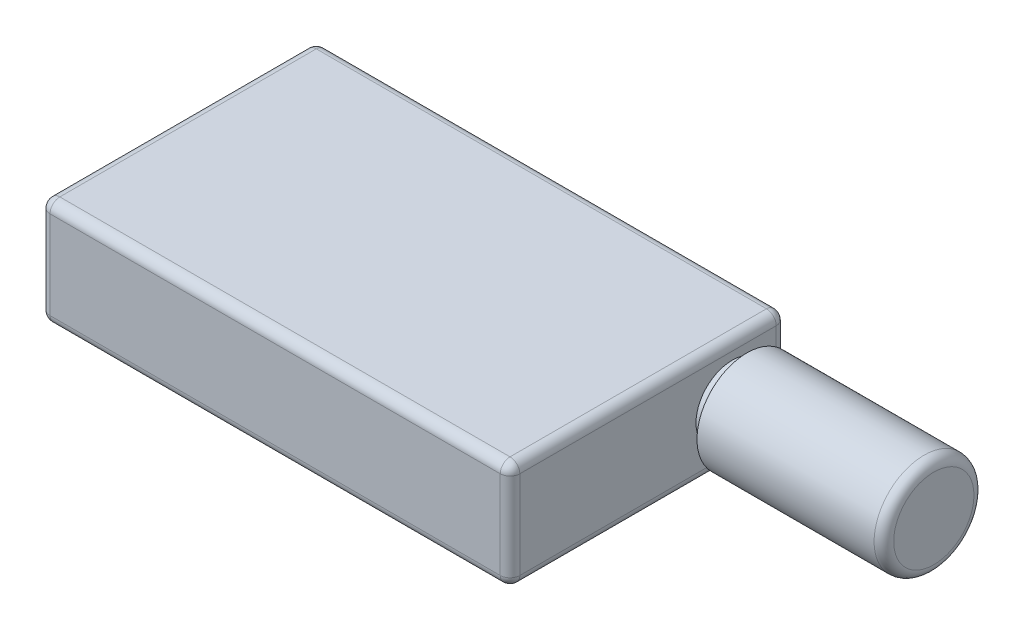
ISO-10303-21;
HEADER;
FILE_DESCRIPTION(('STEP AP214'),'2;1');
FILE_NAME('part.step','',(''),(''),'','','');
FILE_SCHEMA(('AUTOMOTIVE_DESIGN { 1 0 10303 214 1 1 1 1 }'));
ENDSEC;
DATA;
#1=APPLICATION_CONTEXT('core data for automotive mechanical design processes');
#2=APPLICATION_PROTOCOL_DEFINITION('international standard','automotive_design',2000,#1);
#3=PRODUCT_CONTEXT('',#1,'mechanical');
#4=PRODUCT('Part','Part','',(#3));
#5=PRODUCT_RELATED_PRODUCT_CATEGORY('part','',(#4));
#6=PRODUCT_DEFINITION_FORMATION('','',#4);
#7=PRODUCT_DEFINITION_CONTEXT('part definition',#1,'design');
#8=PRODUCT_DEFINITION('design','',#6,#7);
#9=PRODUCT_DEFINITION_SHAPE('','',#8);
#10=(LENGTH_UNIT() NAMED_UNIT(*) SI_UNIT(.MILLI.,.METRE.));
#11=(NAMED_UNIT(*) PLANE_ANGLE_UNIT() SI_UNIT($,.RADIAN.));
#12=(NAMED_UNIT(*) SI_UNIT($,.STERADIAN.) SOLID_ANGLE_UNIT());
#13=UNCERTAINTY_MEASURE_WITH_UNIT(LENGTH_MEASURE(1.E-05),#10,'distance_accuracy_value','');
#14=(GEOMETRIC_REPRESENTATION_CONTEXT(3) GLOBAL_UNCERTAINTY_ASSIGNED_CONTEXT((#13)) GLOBAL_UNIT_ASSIGNED_CONTEXT((#10,
#11,#12)) REPRESENTATION_CONTEXT('',''));
#15=CARTESIAN_POINT('',(0.,0.,0.));
#16=DIRECTION('',(0.,0.,1.));
#17=DIRECTION('',(1.,0.,0.));
#18=AXIS2_PLACEMENT_3D('',#15,#16,#17);
#19=CARTESIAN_POINT('',(0.,11.,0.));
#20=DIRECTION('',(1.,0.,0.));
#21=DIRECTION('',(0.,0.,-1.));
#22=AXIS2_PLACEMENT_3D('',#19,#20,#21);
#23=PLANE('',#22);
#24=DIRECTION('',(0.,0.,1.));
#25=VECTOR('',#24,1.);
#26=CARTESIAN_POINT('',(0.,10.,0.));
#27=LINE('',#26,#25);
#28=CARTESIAN_POINT('',(0.,10.,-1.));
#29=VERTEX_POINT('',#28);
#30=CARTESIAN_POINT('',(0.,10.,-27.2));
#31=VERTEX_POINT('',#30);
#32=EDGE_CURVE('E331',#29,#31,#27,.F.);
#33=ORIENTED_EDGE('',*,*,#32,.T.);
#34=DIRECTION('',(0.,-1.,0.));
#35=VECTOR('',#34,1.);
#36=CARTESIAN_POINT('',(0.,11.,-27.2));
#37=LINE('',#36,#35);
#38=CARTESIAN_POINT('',(0.,1.,-27.2));
#39=VERTEX_POINT('',#38);
#40=EDGE_CURVE('E389',#31,#39,#37,.T.);
#41=ORIENTED_EDGE('',*,*,#40,.T.);
#42=DIRECTION('',(0.,0.,1.));
#43=VECTOR('',#42,1.);
#44=CARTESIAN_POINT('',(0.,1.,0.));
#45=LINE('',#44,#43);
#46=CARTESIAN_POINT('',(0.,1.,-1.));
#47=VERTEX_POINT('',#46);
#48=EDGE_CURVE('E387',#39,#47,#45,.T.);
#49=ORIENTED_EDGE('',*,*,#48,.T.);
#50=DIRECTION('',(0.,-1.,0.));
#51=VECTOR('',#50,1.);
#52=CARTESIAN_POINT('',(0.,11.,-1.));
#53=LINE('',#52,#51);
#54=EDGE_CURVE('E385',#47,#29,#53,.F.);
#55=ORIENTED_EDGE('',*,*,#54,.T.);
#56=EDGE_LOOP('',(#33,#41,#49,#55));
#57=FACE_BOUND('',#56,.T.);
#58=ADVANCED_FACE('F45',(#57),#23,.F.);
#59=CARTESIAN_POINT('',(0.,11.,0.));
#60=DIRECTION('',(0.,0.,-1.));
#61=DIRECTION('',(-1.,0.,0.));
#62=AXIS2_PLACEMENT_3D('',#59,#60,#61);
#63=PLANE('',#62);
#64=DIRECTION('',(0.,-1.,0.));
#65=VECTOR('',#64,1.);
#66=CARTESIAN_POINT('',(1.,11.,0.));
#67=LINE('',#66,#65);
#68=CARTESIAN_POINT('',(1.,10.,0.));
#69=VERTEX_POINT('',#68);
#70=CARTESIAN_POINT('',(1.,1.,0.));
#71=VERTEX_POINT('',#70);
#72=EDGE_CURVE('E396',#69,#71,#67,.T.);
#73=ORIENTED_EDGE('',*,*,#72,.T.);
#74=DIRECTION('',(1.,0.,0.));
#75=VECTOR('',#74,1.);
#76=CARTESIAN_POINT('',(48.,1.,0.));
#77=LINE('',#76,#75);
#78=CARTESIAN_POINT('',(47.,1.,0.));
#79=VERTEX_POINT('',#78);
#80=EDGE_CURVE('E338',#71,#79,#77,.T.);
#81=ORIENTED_EDGE('',*,*,#80,.T.);
#82=DIRECTION('',(0.,-1.,0.));
#83=VECTOR('',#82,1.);
#84=CARTESIAN_POINT('',(47.,11.,0.));
#85=LINE('',#84,#83);
#86=CARTESIAN_POINT('',(47.,10.,0.));
#87=VERTEX_POINT('',#86);
#88=EDGE_CURVE('E394',#79,#87,#85,.F.);
#89=ORIENTED_EDGE('',*,*,#88,.T.);
#90=DIRECTION('',(1.,0.,0.));
#91=VECTOR('',#90,1.);
#92=CARTESIAN_POINT('',(0.,10.,0.));
#93=LINE('',#92,#91);
#94=EDGE_CURVE('E392',#87,#69,#93,.F.);
#95=ORIENTED_EDGE('',*,*,#94,.T.);
#96=EDGE_LOOP('',(#73,#81,#89,#95));
#97=FACE_BOUND('',#96,.T.);
#98=ADVANCED_FACE('F238',(#97),#63,.F.);
#99=CARTESIAN_POINT('',(48.,11.,0.));
#100=DIRECTION('',(-1.,0.,0.));
#101=DIRECTION('',(0.,0.,1.));
#102=AXIS2_PLACEMENT_3D('',#99,#100,#101);
#103=PLANE('',#102);
#104=DIRECTION('',(0.,-1.,0.));
#105=VECTOR('',#104,1.);
#106=CARTESIAN_POINT('',(48.,11.,-1.));
#107=LINE('',#106,#105);
#108=CARTESIAN_POINT('',(48.,10.,-1.));
#109=VERTEX_POINT('',#108);
#110=CARTESIAN_POINT('',(48.,1.,-1.));
#111=VERTEX_POINT('',#110);
#112=EDGE_CURVE('E144',#109,#111,#107,.T.);
#113=ORIENTED_EDGE('',*,*,#112,.T.);
#114=DIRECTION('',(0.,0.,-1.));
#115=VECTOR('',#114,1.);
#116=CARTESIAN_POINT('',(48.,1.,-28.2));
#117=LINE('',#116,#115);
#118=CARTESIAN_POINT('',(48.,1.,-27.2));
#119=VERTEX_POINT('',#118);
#120=EDGE_CURVE('E140',#111,#119,#117,.T.);
#121=ORIENTED_EDGE('',*,*,#120,.T.);
#122=DIRECTION('',(0.,-1.,0.));
#123=VECTOR('',#122,1.);
#124=CARTESIAN_POINT('',(48.,11.,-27.2));
#125=LINE('',#124,#123);
#126=CARTESIAN_POINT('',(48.,10.,-27.2));
#127=VERTEX_POINT('',#126);
#128=EDGE_CURVE('E133',#119,#127,#125,.F.);
#129=ORIENTED_EDGE('',*,*,#128,.T.);
#130=DIRECTION('',(0.,0.,-1.));
#131=VECTOR('',#130,1.);
#132=CARTESIAN_POINT('',(48.,10.,0.));
#133=LINE('',#132,#131);
#134=EDGE_CURVE('E137',#127,#109,#133,.F.);
#135=ORIENTED_EDGE('',*,*,#134,.T.);
#136=EDGE_LOOP('',(#113,#121,#129,#135));
#137=FACE_BOUND('',#136,.T.);
#138=CARTESIAN_POINT('',(48.,5.5,-22.7));
#139=DIRECTION('',(-1.,0.,0.));
#140=DIRECTION('',(0.,0.,1.));
#141=AXIS2_PLACEMENT_3D('',#138,#139,#140);
#142=CIRCLE('',#141,3.7);
#143=CARTESIAN_POINT('',(48.,5.5,-19.));
#144=VERTEX_POINT('',#143);
#145=EDGE_CURVE('E155',#144,#144,#142,.F.);
#146=ORIENTED_EDGE('',*,*,#145,.F.);
#147=EDGE_LOOP('',(#146));
#148=FACE_BOUND('',#147,.T.);
#149=ADVANCED_FACE('F135',(#137,#148),#103,.F.);
#150=CARTESIAN_POINT('',(0.,11.,-28.2));
#151=DIRECTION('',(0.,0.,1.));
#152=DIRECTION('',(1.,0.,0.));
#153=AXIS2_PLACEMENT_3D('',#150,#151,#152);
#154=PLANE('',#153);
#155=DIRECTION('',(-1.,0.,0.));
#156=VECTOR('',#155,1.);
#157=CARTESIAN_POINT('',(0.,10.,-28.2));
#158=LINE('',#157,#156);
#159=CARTESIAN_POINT('',(1.,10.,-28.2));
#160=VERTEX_POINT('',#159);
#161=CARTESIAN_POINT('',(47.,10.,-28.2));
#162=VERTEX_POINT('',#161);
#163=EDGE_CURVE('E373',#160,#162,#158,.F.);
#164=ORIENTED_EDGE('',*,*,#163,.T.);
#165=DIRECTION('',(0.,-1.,0.));
#166=VECTOR('',#165,1.);
#167=CARTESIAN_POINT('',(47.,11.,-28.2));
#168=LINE('',#167,#166);
#169=CARTESIAN_POINT('',(47.,1.,-28.2));
#170=VERTEX_POINT('',#169);
#171=EDGE_CURVE('E167',#162,#170,#168,.T.);
#172=ORIENTED_EDGE('',*,*,#171,.T.);
#173=DIRECTION('',(-1.,0.,0.));
#174=VECTOR('',#173,1.);
#175=CARTESIAN_POINT('',(0.,1.,-28.2));
#176=LINE('',#175,#174);
#177=CARTESIAN_POINT('',(1.,1.,-28.2));
#178=VERTEX_POINT('',#177);
#179=EDGE_CURVE('E381',#170,#178,#176,.T.);
#180=ORIENTED_EDGE('',*,*,#179,.T.);
#181=DIRECTION('',(0.,-1.,0.));
#182=VECTOR('',#181,1.);
#183=CARTESIAN_POINT('',(1.,11.,-28.2));
#184=LINE('',#183,#182);
#185=EDGE_CURVE('E375',#178,#160,#184,.F.);
#186=ORIENTED_EDGE('',*,*,#185,.T.);
#187=EDGE_LOOP('',(#164,#172,#180,#186));
#188=FACE_BOUND('',#187,.T.);
#189=ADVANCED_FACE('F411',(#188),#154,.F.);
#190=CARTESIAN_POINT('',(0.,11.,0.));
#191=DIRECTION('',(0.,-1.,0.));
#192=DIRECTION('',(0.,0.,-1.));
#193=AXIS2_PLACEMENT_3D('',#190,#191,#192);
#194=PLANE('',#193);
#195=DIRECTION('',(0.,0.,-1.));
#196=VECTOR('',#195,1.);
#197=CARTESIAN_POINT('',(47.,11.,0.));
#198=LINE('',#197,#196);
#199=CARTESIAN_POINT('',(47.,11.,-1.));
#200=VERTEX_POINT('',#199);
#201=CARTESIAN_POINT('',(47.,11.,-27.2));
#202=VERTEX_POINT('',#201);
#203=EDGE_CURVE('E60',#200,#202,#198,.T.);
#204=ORIENTED_EDGE('',*,*,#203,.T.);
#205=DIRECTION('',(-1.,0.,0.));
#206=VECTOR('',#205,1.);
#207=CARTESIAN_POINT('',(0.,11.,-27.2));
#208=LINE('',#207,#206);
#209=CARTESIAN_POINT('',(1.,11.,-27.2));
#210=VERTEX_POINT('',#209);
#211=EDGE_CURVE('E219',#202,#210,#208,.T.);
#212=ORIENTED_EDGE('',*,*,#211,.T.);
#213=DIRECTION('',(0.,0.,1.));
#214=VECTOR('',#213,1.);
#215=CARTESIAN_POINT('',(1.,11.,0.));
#216=LINE('',#215,#214);
#217=CARTESIAN_POINT('',(1.,11.,-1.));
#218=VERTEX_POINT('',#217);
#219=EDGE_CURVE('E330',#210,#218,#216,.T.);
#220=ORIENTED_EDGE('',*,*,#219,.T.);
#221=DIRECTION('',(1.,0.,0.));
#222=VECTOR('',#221,1.);
#223=CARTESIAN_POINT('',(0.,11.,-1.));
#224=LINE('',#223,#222);
#225=EDGE_CURVE('E65',#218,#200,#224,.T.);
#226=ORIENTED_EDGE('',*,*,#225,.T.);
#227=EDGE_LOOP('',(#204,#212,#220,#226));
#228=FACE_BOUND('',#227,.T.);
#229=ADVANCED_FACE('F414',(#228),#194,.F.);
#230=CARTESIAN_POINT('',(0.,0.,0.));
#231=DIRECTION('',(0.,-1.,0.));
#232=DIRECTION('',(0.,0.,-1.));
#233=AXIS2_PLACEMENT_3D('',#230,#231,#232);
#234=PLANE('',#233);
#235=DIRECTION('',(-1.,0.,0.));
#236=VECTOR('',#235,1.);
#237=CARTESIAN_POINT('',(48.,0.,-27.2));
#238=LINE('',#237,#236);
#239=CARTESIAN_POINT('',(1.,0.,-27.2));
#240=VERTEX_POINT('',#239);
#241=CARTESIAN_POINT('',(47.,0.,-27.2));
#242=VERTEX_POINT('',#241);
#243=EDGE_CURVE('E370',#240,#242,#238,.F.);
#244=ORIENTED_EDGE('',*,*,#243,.T.);
#245=DIRECTION('',(0.,0.,-1.));
#246=VECTOR('',#245,1.);
#247=CARTESIAN_POINT('',(47.,0.,0.));
#248=LINE('',#247,#246);
#249=CARTESIAN_POINT('',(47.,0.,-1.));
#250=VERTEX_POINT('',#249);
#251=EDGE_CURVE('E367',#242,#250,#248,.F.);
#252=ORIENTED_EDGE('',*,*,#251,.T.);
#253=DIRECTION('',(1.,0.,0.));
#254=VECTOR('',#253,1.);
#255=CARTESIAN_POINT('',(0.,0.,-1.));
#256=LINE('',#255,#254);
#257=CARTESIAN_POINT('',(1.,0.,-1.));
#258=VERTEX_POINT('',#257);
#259=EDGE_CURVE('E359',#250,#258,#256,.F.);
#260=ORIENTED_EDGE('',*,*,#259,.T.);
#261=DIRECTION('',(0.,0.,1.));
#262=VECTOR('',#261,1.);
#263=CARTESIAN_POINT('',(1.,0.,-28.2));
#264=LINE('',#263,#262);
#265=EDGE_CURVE('E364',#258,#240,#264,.F.);
#266=ORIENTED_EDGE('',*,*,#265,.T.);
#267=EDGE_LOOP('',(#244,#252,#260,#266));
#268=FACE_BOUND('',#267,.T.);
#269=ADVANCED_FACE('F368',(#268),#234,.T.);
#270=CARTESIAN_POINT('',(49.5,5.5,-22.7));
#271=DIRECTION('',(-1.,0.,0.));
#272=DIRECTION('',(0.,0.,1.));
#273=AXIS2_PLACEMENT_3D('',#270,#271,#272);
#274=CYLINDRICAL_SURFACE('',#273,3.7);
#275=CARTESIAN_POINT('',(48.5,5.5,-22.7));
#276=DIRECTION('',(1.,0.,0.));
#277=DIRECTION('',(0.,0.,-1.));
#278=AXIS2_PLACEMENT_3D('',#275,#276,#277);
#279=CIRCLE('',#278,3.7);
#280=CARTESIAN_POINT('',(48.5,5.5,-26.4));
#281=VERTEX_POINT('',#280);
#282=EDGE_CURVE('E11',#281,#281,#279,.F.);
#283=ORIENTED_EDGE('',*,*,#282,.T.);
#284=EDGE_LOOP('',(#283));
#285=FACE_BOUND('',#284,.T.);
#286=ORIENTED_EDGE('',*,*,#145,.T.);
#287=EDGE_LOOP('',(#286));
#288=FACE_BOUND('',#287,.T.);
#289=ADVANCED_FACE('F420',(#285,#288),#274,.T.);
#290=CARTESIAN_POINT('',(68.6,5.5,-22.7));
#291=DIRECTION('',(-1.,0.,0.));
#292=DIRECTION('',(0.,0.,1.));
#293=AXIS2_PLACEMENT_3D('',#290,#291,#292);
#294=CYLINDRICAL_SURFACE('',#293,5.1);
#295=CARTESIAN_POINT('',(67.6,5.5,-22.7));
#296=DIRECTION('',(1.,0.,0.));
#297=DIRECTION('',(0.,0.,-1.));
#298=AXIS2_PLACEMENT_3D('',#295,#296,#297);
#299=CIRCLE('',#298,5.1);
#300=CARTESIAN_POINT('',(67.6,5.5,-27.8));
#301=VERTEX_POINT('',#300);
#302=EDGE_CURVE('E218',#301,#301,#299,.F.);
#303=ORIENTED_EDGE('',*,*,#302,.T.);
#304=EDGE_LOOP('',(#303));
#305=FACE_BOUND('',#304,.T.);
#306=CARTESIAN_POINT('',(49.5,5.5,-22.7));
#307=DIRECTION('',(1.,0.,0.));
#308=DIRECTION('',(0.,0.,-1.));
#309=AXIS2_PLACEMENT_3D('',#306,#307,#308);
#310=CIRCLE('',#309,5.1);
#311=CARTESIAN_POINT('',(49.5,5.5,-27.8));
#312=VERTEX_POINT('',#311);
#313=EDGE_CURVE('E214',#312,#312,#310,.T.);
#314=ORIENTED_EDGE('',*,*,#313,.T.);
#315=EDGE_LOOP('',(#314));
#316=FACE_BOUND('',#315,.T.);
#317=ADVANCED_FACE('F455',(#305,#316),#294,.T.);
#318=CARTESIAN_POINT('',(68.6,5.5,-22.7));
#319=DIRECTION('',(1.,0.,0.));
#320=DIRECTION('',(0.,0.,-1.));
#321=AXIS2_PLACEMENT_3D('',#318,#319,#320);
#322=PLANE('',#321);
#323=CARTESIAN_POINT('',(68.6,5.5,-22.7));
#324=DIRECTION('',(1.,0.,0.));
#325=DIRECTION('',(0.,0.,-1.));
#326=AXIS2_PLACEMENT_3D('',#323,#324,#325);
#327=CIRCLE('',#326,4.1);
#328=CARTESIAN_POINT('',(68.6,5.5,-26.8));
#329=VERTEX_POINT('',#328);
#330=EDGE_CURVE('E215',#329,#329,#327,.T.);
#331=ORIENTED_EDGE('',*,*,#330,.T.);
#332=EDGE_LOOP('',(#331));
#333=FACE_BOUND('',#332,.T.);
#334=ADVANCED_FACE('F323',(#333),#322,.T.);
#335=CARTESIAN_POINT('',(49.5,5.5,-22.7));
#336=DIRECTION('',(1.,0.,0.));
#337=DIRECTION('',(0.,0.,-1.));
#338=AXIS2_PLACEMENT_3D('',#335,#336,#337);
#339=PLANE('',#338);
#340=CARTESIAN_POINT('',(49.5,5.5,-22.7));
#341=DIRECTION('',(1.,0.,0.));
#342=DIRECTION('',(0.,0.,-1.));
#343=AXIS2_PLACEMENT_3D('',#340,#341,#342);
#344=CIRCLE('',#343,4.7);
#345=CARTESIAN_POINT('',(49.5,5.5,-27.4));
#346=VERTEX_POINT('',#345);
#347=EDGE_CURVE('E53',#346,#346,#344,.T.);
#348=ORIENTED_EDGE('',*,*,#347,.T.);
#349=EDGE_LOOP('',(#348));
#350=FACE_BOUND('',#349,.T.);
#351=ORIENTED_EDGE('',*,*,#313,.F.);
#352=EDGE_LOOP('',(#351));
#353=FACE_BOUND('',#352,.T.);
#354=ADVANCED_FACE('F224',(#350,#353),#339,.F.);
#355=CARTESIAN_POINT('',(1.,10.,0.));
#356=DIRECTION('',(0.,0.,1.));
#357=DIRECTION('',(1.,0.,0.));
#358=AXIS2_PLACEMENT_3D('',#355,#356,#357);
#359=CYLINDRICAL_SURFACE('',#358,1.);
#360=CARTESIAN_POINT('',(1.,10.,-1.));
#361=DIRECTION('',(0.,0.,1.));
#362=DIRECTION('',(1.,0.,0.));
#363=AXIS2_PLACEMENT_3D('',#360,#361,#362);
#364=CIRCLE('',#363,1.);
#365=EDGE_CURVE('E211',#218,#29,#364,.T.);
#366=ORIENTED_EDGE('',*,*,#365,.F.);
#367=ORIENTED_EDGE('',*,*,#219,.F.);
#368=CARTESIAN_POINT('',(1.,10.,-27.2));
#369=DIRECTION('',(0.,0.,-1.));
#370=DIRECTION('',(-1.,0.,0.));
#371=AXIS2_PLACEMENT_3D('',#368,#369,#370);
#372=CIRCLE('',#371,1.);
#373=EDGE_CURVE('E208',#31,#210,#372,.T.);
#374=ORIENTED_EDGE('',*,*,#373,.F.);
#375=ORIENTED_EDGE('',*,*,#32,.F.);
#376=EDGE_LOOP('',(#366,#367,#374,#375));
#377=FACE_BOUND('',#376,.T.);
#378=ADVANCED_FACE('F316',(#377),#359,.T.);
#379=CARTESIAN_POINT('',(1.,10.,-1.));
#380=DIRECTION('',(-1.,0.,0.));
#381=DIRECTION('',(0.,0.,1.));
#382=AXIS2_PLACEMENT_3D('',#379,#380,#381);
#383=SPHERICAL_SURFACE('',#382,1.);
#384=CARTESIAN_POINT('',(1.,10.,-1.));
#385=DIRECTION('',(-1.,0.,0.));
#386=DIRECTION('',(0.,0.,1.));
#387=AXIS2_PLACEMENT_3D('',#384,#385,#386);
#388=CIRCLE('',#387,1.);
#389=EDGE_CURVE('E202',#218,#69,#388,.F.);
#390=ORIENTED_EDGE('',*,*,#389,.F.);
#391=ORIENTED_EDGE('',*,*,#365,.T.);
#392=CARTESIAN_POINT('',(1.,10.,-1.));
#393=DIRECTION('',(0.,1.,0.));
#394=DIRECTION('',(0.,0.,1.));
#395=AXIS2_PLACEMENT_3D('',#392,#393,#394);
#396=CIRCLE('',#395,1.);
#397=EDGE_CURVE('E205',#69,#29,#396,.F.);
#398=ORIENTED_EDGE('',*,*,#397,.F.);
#399=EDGE_LOOP('',(#390,#391,#398));
#400=FACE_BOUND('',#399,.T.);
#401=ADVANCED_FACE('F312',(#400),#383,.T.);
#402=CARTESIAN_POINT('',(1.,10.,-27.2));
#403=DIRECTION('',(0.,1.,0.));
#404=DIRECTION('',(0.,0.,1.));
#405=AXIS2_PLACEMENT_3D('',#402,#403,#404);
#406=SPHERICAL_SURFACE('',#405,1.);
#407=CARTESIAN_POINT('',(1.,10.,-27.2));
#408=DIRECTION('',(0.,1.,0.));
#409=DIRECTION('',(0.,0.,1.));
#410=AXIS2_PLACEMENT_3D('',#407,#408,#409);
#411=CIRCLE('',#410,1.);
#412=EDGE_CURVE('E197',#31,#160,#411,.F.);
#413=ORIENTED_EDGE('',*,*,#412,.F.);
#414=ORIENTED_EDGE('',*,*,#373,.T.);
#415=CARTESIAN_POINT('',(1.,10.,-27.2));
#416=DIRECTION('',(-1.,0.,0.));
#417=DIRECTION('',(0.,0.,1.));
#418=AXIS2_PLACEMENT_3D('',#415,#416,#417);
#419=CIRCLE('',#418,1.);
#420=EDGE_CURVE('E200',#160,#210,#419,.F.);
#421=ORIENTED_EDGE('',*,*,#420,.F.);
#422=EDGE_LOOP('',(#413,#414,#421));
#423=FACE_BOUND('',#422,.T.);
#424=ADVANCED_FACE('F308',(#423),#406,.T.);
#425=CARTESIAN_POINT('',(1.,11.,-1.));
#426=DIRECTION('',(0.,-1.,0.));
#427=DIRECTION('',(0.,0.,-1.));
#428=AXIS2_PLACEMENT_3D('',#425,#426,#427);
#429=CYLINDRICAL_SURFACE('',#428,1.);
#430=ORIENTED_EDGE('',*,*,#397,.T.);
#431=ORIENTED_EDGE('',*,*,#54,.F.);
#432=CARTESIAN_POINT('',(1.,1.,-1.));
#433=DIRECTION('',(0.,-1.,0.));
#434=DIRECTION('',(0.,0.,-1.));
#435=AXIS2_PLACEMENT_3D('',#432,#433,#434);
#436=CIRCLE('',#435,1.);
#437=EDGE_CURVE('E191',#71,#47,#436,.T.);
#438=ORIENTED_EDGE('',*,*,#437,.F.);
#439=ORIENTED_EDGE('',*,*,#72,.F.);
#440=EDGE_LOOP('',(#430,#431,#438,#439));
#441=FACE_BOUND('',#440,.T.);
#442=ADVANCED_FACE('F304',(#441),#429,.T.);
#443=CARTESIAN_POINT('',(0.,10.,-1.));
#444=DIRECTION('',(1.,0.,0.));
#445=DIRECTION('',(0.,0.,-1.));
#446=AXIS2_PLACEMENT_3D('',#443,#444,#445);
#447=CYLINDRICAL_SURFACE('',#446,1.);
#448=ORIENTED_EDGE('',*,*,#389,.T.);
#449=ORIENTED_EDGE('',*,*,#94,.F.);
#450=CARTESIAN_POINT('',(47.,10.,-1.));
#451=DIRECTION('',(1.,0.,0.));
#452=DIRECTION('',(0.,0.,-1.));
#453=AXIS2_PLACEMENT_3D('',#450,#451,#452);
#454=CIRCLE('',#453,1.);
#455=EDGE_CURVE('E188',#200,#87,#454,.T.);
#456=ORIENTED_EDGE('',*,*,#455,.F.);
#457=ORIENTED_EDGE('',*,*,#225,.F.);
#458=EDGE_LOOP('',(#448,#449,#456,#457));
#459=FACE_BOUND('',#458,.T.);
#460=ADVANCED_FACE('F301',(#459),#447,.T.);
#461=CARTESIAN_POINT('',(47.,10.,0.));
#462=DIRECTION('',(0.,0.,-1.));
#463=DIRECTION('',(-1.,0.,0.));
#464=AXIS2_PLACEMENT_3D('',#461,#462,#463);
#465=CYLINDRICAL_SURFACE('',#464,1.);
#466=CARTESIAN_POINT('',(47.,10.,-27.2));
#467=DIRECTION('',(0.,0.,-1.));
#468=DIRECTION('',(-1.,0.,0.));
#469=AXIS2_PLACEMENT_3D('',#466,#467,#468);
#470=CIRCLE('',#469,1.);
#471=EDGE_CURVE('E150',#202,#127,#470,.T.);
#472=ORIENTED_EDGE('',*,*,#471,.F.);
#473=ORIENTED_EDGE('',*,*,#203,.F.);
#474=CARTESIAN_POINT('',(47.,10.,-1.));
#475=DIRECTION('',(0.,0.,1.));
#476=DIRECTION('',(1.,0.,0.));
#477=AXIS2_PLACEMENT_3D('',#474,#475,#476);
#478=CIRCLE('',#477,1.);
#479=EDGE_CURVE('E153',#109,#200,#478,.T.);
#480=ORIENTED_EDGE('',*,*,#479,.F.);
#481=ORIENTED_EDGE('',*,*,#134,.F.);
#482=EDGE_LOOP('',(#472,#473,#480,#481));
#483=FACE_BOUND('',#482,.T.);
#484=ADVANCED_FACE('F149',(#483),#465,.T.);
#485=CARTESIAN_POINT('',(0.,10.,-27.2));
#486=DIRECTION('',(-1.,0.,0.));
#487=DIRECTION('',(0.,0.,1.));
#488=AXIS2_PLACEMENT_3D('',#485,#486,#487);
#489=CYLINDRICAL_SURFACE('',#488,1.);
#490=ORIENTED_EDGE('',*,*,#420,.T.);
#491=ORIENTED_EDGE('',*,*,#211,.F.);
#492=CARTESIAN_POINT('',(47.,10.,-27.2));
#493=DIRECTION('',(1.,0.,0.));
#494=DIRECTION('',(0.,0.,-1.));
#495=AXIS2_PLACEMENT_3D('',#492,#493,#494);
#496=CIRCLE('',#495,1.);
#497=EDGE_CURVE('E163',#162,#202,#496,.T.);
#498=ORIENTED_EDGE('',*,*,#497,.F.);
#499=ORIENTED_EDGE('',*,*,#163,.F.);
#500=EDGE_LOOP('',(#490,#491,#498,#499));
#501=FACE_BOUND('',#500,.T.);
#502=ADVANCED_FACE('F294',(#501),#489,.T.);
#503=CARTESIAN_POINT('',(1.,11.,-27.2));
#504=DIRECTION('',(0.,-1.,0.));
#505=DIRECTION('',(0.,0.,-1.));
#506=AXIS2_PLACEMENT_3D('',#503,#504,#505);
#507=CYLINDRICAL_SURFACE('',#506,1.);
#508=ORIENTED_EDGE('',*,*,#412,.T.);
#509=ORIENTED_EDGE('',*,*,#185,.F.);
#510=CARTESIAN_POINT('',(1.,1.,-27.2));
#511=DIRECTION('',(0.,-1.,0.));
#512=DIRECTION('',(0.,0.,-1.));
#513=AXIS2_PLACEMENT_3D('',#510,#511,#512);
#514=CIRCLE('',#513,1.);
#515=EDGE_CURVE('E183',#39,#178,#514,.T.);
#516=ORIENTED_EDGE('',*,*,#515,.F.);
#517=ORIENTED_EDGE('',*,*,#40,.F.);
#518=EDGE_LOOP('',(#508,#509,#516,#517));
#519=FACE_BOUND('',#518,.T.);
#520=ADVANCED_FACE('F290',(#519),#507,.T.);
#521=CARTESIAN_POINT('',(1.,1.,0.));
#522=DIRECTION('',(0.,0.,-1.));
#523=DIRECTION('',(-1.,0.,0.));
#524=AXIS2_PLACEMENT_3D('',#521,#522,#523);
#525=CYLINDRICAL_SURFACE('',#524,1.);
#526=CARTESIAN_POINT('',(1.,1.,-1.));
#527=DIRECTION('',(0.,0.,1.));
#528=DIRECTION('',(1.,0.,0.));
#529=AXIS2_PLACEMENT_3D('',#526,#527,#528);
#530=CIRCLE('',#529,1.);
#531=EDGE_CURVE('E194',#47,#258,#530,.T.);
#532=ORIENTED_EDGE('',*,*,#531,.F.);
#533=ORIENTED_EDGE('',*,*,#48,.F.);
#534=CARTESIAN_POINT('',(1.,1.,-27.2));
#535=DIRECTION('',(0.,0.,-1.));
#536=DIRECTION('',(-1.,0.,0.));
#537=AXIS2_PLACEMENT_3D('',#534,#535,#536);
#538=CIRCLE('',#537,1.);
#539=EDGE_CURVE('E181',#240,#39,#538,.T.);
#540=ORIENTED_EDGE('',*,*,#539,.F.);
#541=ORIENTED_EDGE('',*,*,#265,.F.);
#542=EDGE_LOOP('',(#532,#533,#540,#541));
#543=FACE_BOUND('',#542,.T.);
#544=ADVANCED_FACE('F286',(#543),#525,.T.);
#545=CARTESIAN_POINT('',(1.,1.,-1.));
#546=DIRECTION('',(-1.,0.,0.));
#547=DIRECTION('',(0.,-1.,0.));
#548=AXIS2_PLACEMENT_3D('',#545,#546,#547);
#549=SPHERICAL_SURFACE('',#548,1.);
#550=ORIENTED_EDGE('',*,*,#437,.T.);
#551=ORIENTED_EDGE('',*,*,#531,.T.);
#552=CARTESIAN_POINT('',(1.,1.,-1.));
#553=DIRECTION('',(-1.,0.,0.));
#554=DIRECTION('',(0.,0.,1.));
#555=AXIS2_PLACEMENT_3D('',#552,#553,#554);
#556=CIRCLE('',#555,1.);
#557=EDGE_CURVE('E172',#71,#258,#556,.F.);
#558=ORIENTED_EDGE('',*,*,#557,.F.);
#559=EDGE_LOOP('',(#550,#551,#558));
#560=FACE_BOUND('',#559,.T.);
#561=ADVANCED_FACE('F282',(#560),#549,.T.);
#562=CARTESIAN_POINT('',(47.,10.,-1.));
#563=DIRECTION('',(0.,1.,0.));
#564=DIRECTION('',(0.,0.,1.));
#565=AXIS2_PLACEMENT_3D('',#562,#563,#564);
#566=SPHERICAL_SURFACE('',#565,1.);
#567=ORIENTED_EDGE('',*,*,#479,.T.);
#568=ORIENTED_EDGE('',*,*,#455,.T.);
#569=CARTESIAN_POINT('',(47.,10.,-1.));
#570=DIRECTION('',(0.,1.,0.));
#571=DIRECTION('',(0.,0.,1.));
#572=AXIS2_PLACEMENT_3D('',#569,#570,#571);
#573=CIRCLE('',#572,1.);
#574=EDGE_CURVE('E168',#109,#87,#573,.F.);
#575=ORIENTED_EDGE('',*,*,#574,.F.);
#576=EDGE_LOOP('',(#567,#568,#575));
#577=FACE_BOUND('',#576,.T.);
#578=ADVANCED_FACE('F279',(#577),#566,.T.);
#579=CARTESIAN_POINT('',(47.,10.,-27.2));
#580=DIRECTION('',(0.,1.,0.));
#581=DIRECTION('',(0.,0.,1.));
#582=AXIS2_PLACEMENT_3D('',#579,#580,#581);
#583=SPHERICAL_SURFACE('',#582,1.);
#584=ORIENTED_EDGE('',*,*,#497,.T.);
#585=ORIENTED_EDGE('',*,*,#471,.T.);
#586=CARTESIAN_POINT('',(47.,10.,-27.2));
#587=DIRECTION('',(0.,1.,0.));
#588=DIRECTION('',(0.,0.,1.));
#589=AXIS2_PLACEMENT_3D('',#586,#587,#588);
#590=CIRCLE('',#589,1.);
#591=EDGE_CURVE('E160',#162,#127,#590,.F.);
#592=ORIENTED_EDGE('',*,*,#591,.F.);
#593=EDGE_LOOP('',(#584,#585,#592));
#594=FACE_BOUND('',#593,.T.);
#595=ADVANCED_FACE('F159',(#594),#583,.T.);
#596=CARTESIAN_POINT('',(1.,1.,-27.2));
#597=DIRECTION('',(-1.,0.,0.));
#598=DIRECTION('',(0.,-1.,0.));
#599=AXIS2_PLACEMENT_3D('',#596,#597,#598);
#600=SPHERICAL_SURFACE('',#599,1.);
#601=ORIENTED_EDGE('',*,*,#539,.T.);
#602=ORIENTED_EDGE('',*,*,#515,.T.);
#603=CARTESIAN_POINT('',(1.,1.,-27.2));
#604=DIRECTION('',(-1.,0.,0.));
#605=DIRECTION('',(0.,0.,1.));
#606=AXIS2_PLACEMENT_3D('',#603,#604,#605);
#607=CIRCLE('',#606,1.);
#608=EDGE_CURVE('E169',#240,#178,#607,.F.);
#609=ORIENTED_EDGE('',*,*,#608,.F.);
#610=EDGE_LOOP('',(#601,#602,#609));
#611=FACE_BOUND('',#610,.T.);
#612=ADVANCED_FACE('F272',(#611),#600,.T.);
#613=CARTESIAN_POINT('',(0.,1.,-1.));
#614=DIRECTION('',(-1.,0.,0.));
#615=DIRECTION('',(0.,0.,1.));
#616=AXIS2_PLACEMENT_3D('',#613,#614,#615);
#617=CYLINDRICAL_SURFACE('',#616,1.);
#618=ORIENTED_EDGE('',*,*,#557,.T.);
#619=ORIENTED_EDGE('',*,*,#259,.F.);
#620=CARTESIAN_POINT('',(47.,1.,-1.));
#621=DIRECTION('',(1.,0.,0.));
#622=DIRECTION('',(0.,0.,-1.));
#623=AXIS2_PLACEMENT_3D('',#620,#621,#622);
#624=CIRCLE('',#623,1.);
#625=EDGE_CURVE('E175',#79,#250,#624,.T.);
#626=ORIENTED_EDGE('',*,*,#625,.F.);
#627=ORIENTED_EDGE('',*,*,#80,.F.);
#628=EDGE_LOOP('',(#618,#619,#626,#627));
#629=FACE_BOUND('',#628,.T.);
#630=ADVANCED_FACE('F268',(#629),#617,.T.);
#631=CARTESIAN_POINT('',(47.,11.,-1.));
#632=DIRECTION('',(0.,-1.,0.));
#633=DIRECTION('',(0.,0.,-1.));
#634=AXIS2_PLACEMENT_3D('',#631,#632,#633);
#635=CYLINDRICAL_SURFACE('',#634,1.);
#636=ORIENTED_EDGE('',*,*,#574,.T.);
#637=ORIENTED_EDGE('',*,*,#88,.F.);
#638=CARTESIAN_POINT('',(47.,1.,-1.));
#639=DIRECTION('',(0.,-1.,0.));
#640=DIRECTION('',(0.,0.,-1.));
#641=AXIS2_PLACEMENT_3D('',#638,#639,#640);
#642=CIRCLE('',#641,1.);
#643=EDGE_CURVE('E352',#111,#79,#642,.T.);
#644=ORIENTED_EDGE('',*,*,#643,.F.);
#645=ORIENTED_EDGE('',*,*,#112,.F.);
#646=EDGE_LOOP('',(#636,#637,#644,#645));
#647=FACE_BOUND('',#646,.T.);
#648=ADVANCED_FACE('F265',(#647),#635,.T.);
#649=CARTESIAN_POINT('',(47.,11.,-27.2));
#650=DIRECTION('',(0.,-1.,0.));
#651=DIRECTION('',(0.,0.,-1.));
#652=AXIS2_PLACEMENT_3D('',#649,#650,#651);
#653=CYLINDRICAL_SURFACE('',#652,1.);
#654=ORIENTED_EDGE('',*,*,#591,.T.);
#655=ORIENTED_EDGE('',*,*,#128,.F.);
#656=CARTESIAN_POINT('',(47.,1.,-27.2));
#657=DIRECTION('',(0.,-1.,0.));
#658=DIRECTION('',(0.,0.,-1.));
#659=AXIS2_PLACEMENT_3D('',#656,#657,#658);
#660=CIRCLE('',#659,1.);
#661=EDGE_CURVE('E349',#170,#119,#660,.T.);
#662=ORIENTED_EDGE('',*,*,#661,.F.);
#663=ORIENTED_EDGE('',*,*,#171,.F.);
#664=EDGE_LOOP('',(#654,#655,#662,#663));
#665=FACE_BOUND('',#664,.T.);
#666=ADVANCED_FACE('F165',(#665),#653,.T.);
#667=CARTESIAN_POINT('',(0.,1.,-27.2));
#668=DIRECTION('',(1.,0.,0.));
#669=DIRECTION('',(0.,0.,-1.));
#670=AXIS2_PLACEMENT_3D('',#667,#668,#669);
#671=CYLINDRICAL_SURFACE('',#670,1.);
#672=ORIENTED_EDGE('',*,*,#608,.T.);
#673=ORIENTED_EDGE('',*,*,#179,.F.);
#674=CARTESIAN_POINT('',(47.,1.,-27.2));
#675=DIRECTION('',(1.,0.,0.));
#676=DIRECTION('',(0.,0.,-1.));
#677=AXIS2_PLACEMENT_3D('',#674,#675,#676);
#678=CIRCLE('',#677,1.);
#679=EDGE_CURVE('E347',#242,#170,#678,.T.);
#680=ORIENTED_EDGE('',*,*,#679,.F.);
#681=ORIENTED_EDGE('',*,*,#243,.F.);
#682=EDGE_LOOP('',(#672,#673,#680,#681));
#683=FACE_BOUND('',#682,.T.);
#684=ADVANCED_FACE('F258',(#683),#671,.T.);
#685=CARTESIAN_POINT('',(47.,1.,-1.));
#686=DIRECTION('',(0.,0.,1.));
#687=DIRECTION('',(0.,-1.,0.));
#688=AXIS2_PLACEMENT_3D('',#685,#686,#687);
#689=SPHERICAL_SURFACE('',#688,1.);
#690=ORIENTED_EDGE('',*,*,#643,.T.);
#691=ORIENTED_EDGE('',*,*,#625,.T.);
#692=CARTESIAN_POINT('',(47.,1.,-1.));
#693=DIRECTION('',(0.,0.,1.));
#694=DIRECTION('',(1.,0.,0.));
#695=AXIS2_PLACEMENT_3D('',#692,#693,#694);
#696=CIRCLE('',#695,1.);
#697=EDGE_CURVE('E345',#111,#250,#696,.F.);
#698=ORIENTED_EDGE('',*,*,#697,.F.);
#699=EDGE_LOOP('',(#690,#691,#698));
#700=FACE_BOUND('',#699,.T.);
#701=ADVANCED_FACE('F254',(#700),#689,.T.);
#702=CARTESIAN_POINT('',(47.,1.,-27.2));
#703=DIRECTION('',(0.,0.,-1.));
#704=DIRECTION('',(0.,1.,0.));
#705=AXIS2_PLACEMENT_3D('',#702,#703,#704);
#706=SPHERICAL_SURFACE('',#705,1.);
#707=ORIENTED_EDGE('',*,*,#679,.T.);
#708=ORIENTED_EDGE('',*,*,#661,.T.);
#709=CARTESIAN_POINT('',(47.,1.,-27.2));
#710=DIRECTION('',(0.,0.,-1.));
#711=DIRECTION('',(-1.,0.,0.));
#712=AXIS2_PLACEMENT_3D('',#709,#710,#711);
#713=CIRCLE('',#712,1.);
#714=EDGE_CURVE('E343',#242,#119,#713,.F.);
#715=ORIENTED_EDGE('',*,*,#714,.F.);
#716=EDGE_LOOP('',(#707,#708,#715));
#717=FACE_BOUND('',#716,.T.);
#718=ADVANCED_FACE('F250',(#717),#706,.T.);
#719=CARTESIAN_POINT('',(47.,1.,0.));
#720=DIRECTION('',(0.,0.,1.));
#721=DIRECTION('',(1.,0.,0.));
#722=AXIS2_PLACEMENT_3D('',#719,#720,#721);
#723=CYLINDRICAL_SURFACE('',#722,1.);
#724=ORIENTED_EDGE('',*,*,#697,.T.);
#725=ORIENTED_EDGE('',*,*,#251,.F.);
#726=ORIENTED_EDGE('',*,*,#714,.T.);
#727=ORIENTED_EDGE('',*,*,#120,.F.);
#728=EDGE_LOOP('',(#724,#725,#726,#727));
#729=FACE_BOUND('',#728,.T.);
#730=ADVANCED_FACE('F234',(#729),#723,.T.);
#731=CARTESIAN_POINT('',(67.6,5.5,-22.7));
#732=DIRECTION('',(1.,0.,0.));
#733=DIRECTION('',(0.,0.,-1.));
#734=AXIS2_PLACEMENT_3D('',#731,#732,#733);
#735=TOROIDAL_SURFACE('',#734,4.1,1.);
#736=ORIENTED_EDGE('',*,*,#302,.F.);
#737=EDGE_LOOP('',(#736));
#738=FACE_BOUND('',#737,.T.);
#739=ORIENTED_EDGE('',*,*,#330,.F.);
#740=EDGE_LOOP('',(#739));
#741=FACE_BOUND('',#740,.T.);
#742=ADVANCED_FACE('F228',(#738,#741),#735,.T.);
#743=CARTESIAN_POINT('',(48.5,5.5,-22.7));
#744=DIRECTION('',(1.,0.,0.));
#745=DIRECTION('',(0.,0.,-1.));
#746=AXIS2_PLACEMENT_3D('',#743,#744,#745);
#747=TOROIDAL_SURFACE('',#746,4.7,1.);
#748=ORIENTED_EDGE('',*,*,#282,.F.);
#749=EDGE_LOOP('',(#748));
#750=FACE_BOUND('',#749,.T.);
#751=ORIENTED_EDGE('',*,*,#347,.F.);
#752=EDGE_LOOP('',(#751));
#753=FACE_BOUND('',#752,.T.);
#754=ADVANCED_FACE('F47',(#750,#753),#747,.F.);
#755=CLOSED_SHELL('',(#58,#98,#149,#189,#229,#269,#289,#317,#334,#354,#378,#401,#424,#442,#460,
#484,#502,#520,#544,#561,#578,#595,#612,#630,#648,#666,#684,#701,#718,#730,#742,#754));
#756=MANIFOLD_SOLID_BREP('B2',#755);
#757=ADVANCED_BREP_SHAPE_REPRESENTATION('',(#18,#756),#14);
#758=SHAPE_DEFINITION_REPRESENTATION(#9,#757);
ENDSEC;
END-ISO-10303-21;
